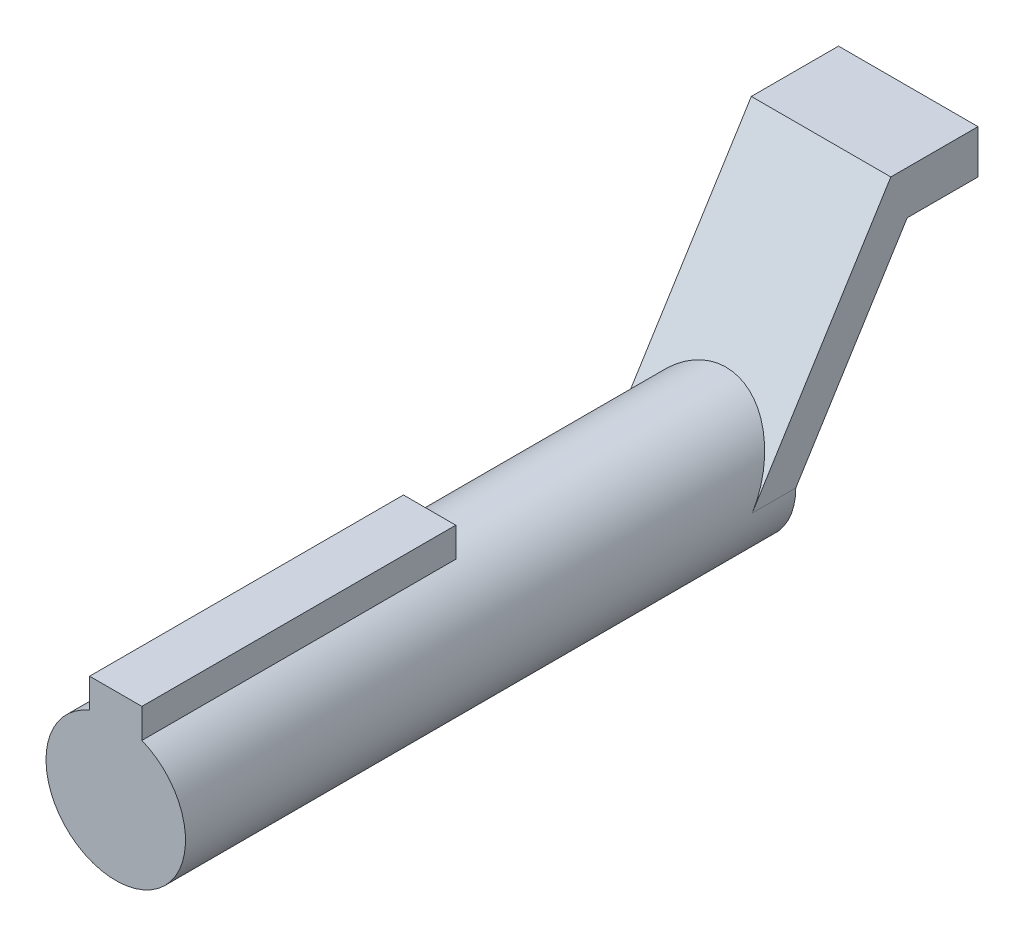
ISO-10303-21;
HEADER;
FILE_DESCRIPTION(('STEP AP214'),'2;1');
FILE_NAME('part.step','',(''),(''),'','','');
FILE_SCHEMA(('AUTOMOTIVE_DESIGN { 1 0 10303 214 1 1 1 1 }'));
ENDSEC;
DATA;
#1=APPLICATION_CONTEXT('core data for automotive mechanical design processes');
#2=APPLICATION_PROTOCOL_DEFINITION('international standard','automotive_design',2000,#1);
#3=PRODUCT_CONTEXT('',#1,'mechanical');
#4=PRODUCT('Part','Part','',(#3));
#5=PRODUCT_RELATED_PRODUCT_CATEGORY('part','',(#4));
#6=PRODUCT_DEFINITION_FORMATION('','',#4);
#7=PRODUCT_DEFINITION_CONTEXT('part definition',#1,'design');
#8=PRODUCT_DEFINITION('design','',#6,#7);
#9=PRODUCT_DEFINITION_SHAPE('','',#8);
#10=(LENGTH_UNIT() NAMED_UNIT(*) SI_UNIT(.MILLI.,.METRE.));
#11=(NAMED_UNIT(*) PLANE_ANGLE_UNIT() SI_UNIT($,.RADIAN.));
#12=(NAMED_UNIT(*) SI_UNIT($,.STERADIAN.) SOLID_ANGLE_UNIT());
#13=UNCERTAINTY_MEASURE_WITH_UNIT(LENGTH_MEASURE(1.E-05),#10,'distance_accuracy_value','');
#14=(GEOMETRIC_REPRESENTATION_CONTEXT(3) GLOBAL_UNCERTAINTY_ASSIGNED_CONTEXT((#13)) GLOBAL_UNIT_ASSIGNED_CONTEXT((#10,
#11,#12)) REPRESENTATION_CONTEXT('',''));
#15=CARTESIAN_POINT('',(0.,0.,0.));
#16=DIRECTION('',(0.,0.,1.));
#17=DIRECTION('',(1.,0.,0.));
#18=AXIS2_PLACEMENT_3D('',#15,#16,#17);
#19=CARTESIAN_POINT('',(0.,0.,35.));
#20=DIRECTION('',(0.,0.,-1.));
#21=DIRECTION('',(-1.,0.,0.));
#22=AXIS2_PLACEMENT_3D('',#19,#20,#21);
#23=CYLINDRICAL_SURFACE('',#22,4.);
#24=DIRECTION('',(0.,0.,-1.));
#25=VECTOR('',#24,1.);
#26=CARTESIAN_POINT('',(4.,0.,0.));
#27=LINE('',#26,#25);
#28=CARTESIAN_POINT('',(4.,0.,2.5));
#29=VERTEX_POINT('',#28);
#30=CARTESIAN_POINT('',(4.,0.,0.));
#31=VERTEX_POINT('',#30);
#32=EDGE_CURVE('E68',#29,#31,#27,.T.);
#33=ORIENTED_EDGE('',*,*,#32,.F.);
#34=CARTESIAN_POINT('',(0.,0.,2.5));
#35=DIRECTION('',(0.,0.52999894000318,0.847998304005088));
#36=DIRECTION('',(0.,0.847998304005088,-0.52999894000318));
#37=AXIS2_PLACEMENT_3D('',#34,#35,#36);
#38=ELLIPSE('',#37,4.7169905660283,4.);
#39=CARTESIAN_POINT('',(-4.,0.,2.5));
#40=VERTEX_POINT('',#39);
#41=EDGE_CURVE('E214',#29,#40,#38,.T.);
#42=ORIENTED_EDGE('',*,*,#41,.T.);
#43=DIRECTION('',(0.,0.,-1.));
#44=VECTOR('',#43,1.);
#45=CARTESIAN_POINT('',(-4.,0.,0.));
#46=LINE('',#45,#44);
#47=CARTESIAN_POINT('',(-4.,0.,0.));
#48=VERTEX_POINT('',#47);
#49=EDGE_CURVE('E173',#40,#48,#46,.T.);
#50=ORIENTED_EDGE('',*,*,#49,.T.);
#51=CARTESIAN_POINT('',(0.,0.,0.));
#52=DIRECTION('',(0.,0.,1.));
#53=DIRECTION('',(1.,0.,0.));
#54=AXIS2_PLACEMENT_3D('',#51,#52,#53);
#55=CIRCLE('',#54,4.);
#56=EDGE_CURVE('E229',#48,#31,#55,.T.);
#57=ORIENTED_EDGE('',*,*,#56,.T.);
#58=EDGE_LOOP('',(#33,#42,#50,#57));
#59=FACE_BOUND('',#58,.T.);
#60=DIRECTION('',(0.,0.,-1.));
#61=VECTOR('',#60,1.);
#62=CARTESIAN_POINT('',(-1.5,3.70809924354783,35.));
#63=LINE('',#62,#61);
#64=CARTESIAN_POINT('',(-1.5,3.70809924354783,17.));
#65=VERTEX_POINT('',#64);
#66=CARTESIAN_POINT('',(-1.5,3.70809924354783,35.));
#67=VERTEX_POINT('',#66);
#68=EDGE_CURVE('E159',#65,#67,#63,.F.);
#69=ORIENTED_EDGE('',*,*,#68,.F.);
#70=CARTESIAN_POINT('',(0.,0.,17.));
#71=DIRECTION('',(0.,0.,-1.));
#72=DIRECTION('',(-1.,0.,0.));
#73=AXIS2_PLACEMENT_3D('',#70,#71,#72);
#74=CIRCLE('',#73,4.);
#75=CARTESIAN_POINT('',(1.5,3.70809924354783,17.));
#76=VERTEX_POINT('',#75);
#77=EDGE_CURVE('E11',#65,#76,#74,.T.);
#78=ORIENTED_EDGE('',*,*,#77,.T.);
#79=DIRECTION('',(0.,0.,-1.));
#80=VECTOR('',#79,1.);
#81=CARTESIAN_POINT('',(1.5,3.70809924354783,35.));
#82=LINE('',#81,#80);
#83=CARTESIAN_POINT('',(1.5,3.70809924354783,35.));
#84=VERTEX_POINT('',#83);
#85=EDGE_CURVE('E154',#76,#84,#82,.F.);
#86=ORIENTED_EDGE('',*,*,#85,.T.);
#87=CARTESIAN_POINT('',(0.,0.,35.));
#88=DIRECTION('',(0.,0.,1.));
#89=DIRECTION('',(1.,0.,0.));
#90=AXIS2_PLACEMENT_3D('',#87,#88,#89);
#91=CIRCLE('',#90,4.);
#92=EDGE_CURVE('E53',#67,#84,#91,.T.);
#93=ORIENTED_EDGE('',*,*,#92,.F.);
#94=EDGE_LOOP('',(#69,#78,#86,#93));
#95=FACE_BOUND('',#94,.T.);
#96=ADVANCED_FACE('F45',(#59,#95),#23,.T.);
#97=CARTESIAN_POINT('',(0.,0.,0.));
#98=DIRECTION('',(0.,0.,1.));
#99=DIRECTION('',(1.,0.,0.));
#100=AXIS2_PLACEMENT_3D('',#97,#98,#99);
#101=PLANE('',#100);
#102=DIRECTION('',(-1.,0.,0.));
#103=VECTOR('',#102,1.);
#104=CARTESIAN_POINT('',(22.1521304810338,0.,0.));
#105=LINE('',#104,#103);
#106=EDGE_CURVE('E219',#31,#48,#105,.T.);
#107=ORIENTED_EDGE('',*,*,#106,.F.);
#108=ORIENTED_EDGE('',*,*,#56,.F.);
#109=EDGE_LOOP('',(#107,#108));
#110=FACE_BOUND('',#109,.T.);
#111=ADVANCED_FACE('F272',(#110),#101,.F.);
#112=CARTESIAN_POINT('',(0.,0.,35.));
#113=DIRECTION('',(0.,0.,1.));
#114=DIRECTION('',(1.,0.,0.));
#115=AXIS2_PLACEMENT_3D('',#112,#113,#114);
#116=PLANE('',#115);
#117=ORIENTED_EDGE('',*,*,#92,.T.);
#118=DIRECTION('',(0.,1.,0.));
#119=VECTOR('',#118,1.);
#120=CARTESIAN_POINT('',(1.5,0.,35.));
#121=LINE('',#120,#119);
#122=CARTESIAN_POINT('',(1.5,5.4,35.));
#123=VERTEX_POINT('',#122);
#124=EDGE_CURVE('E140',#84,#123,#121,.T.);
#125=ORIENTED_EDGE('',*,*,#124,.T.);
#126=DIRECTION('',(1.,0.,0.));
#127=VECTOR('',#126,1.);
#128=CARTESIAN_POINT('',(-1.5,5.4,35.));
#129=LINE('',#128,#127);
#130=CARTESIAN_POINT('',(-1.5,5.4,35.));
#131=VERTEX_POINT('',#130);
#132=EDGE_CURVE('E389',#131,#123,#129,.T.);
#133=ORIENTED_EDGE('',*,*,#132,.F.);
#134=DIRECTION('',(0.,1.,0.));
#135=VECTOR('',#134,1.);
#136=CARTESIAN_POINT('',(-1.5,0.,35.));
#137=LINE('',#136,#135);
#138=EDGE_CURVE('E60',#67,#131,#137,.T.);
#139=ORIENTED_EDGE('',*,*,#138,.F.);
#140=EDGE_LOOP('',(#117,#125,#133,#139));
#141=FACE_BOUND('',#140,.T.);
#142=ADVANCED_FACE('F268',(#141),#116,.T.);
#143=CARTESIAN_POINT('',(22.1521304810338,1.12359550561798,1.79775280898876));
#144=DIRECTION('',(0.,0.52999894000318,0.847998304005088));
#145=DIRECTION('',(0.,-0.847998304005088,0.52999894000318));
#146=AXIS2_PLACEMENT_3D('',#143,#144,#145);
#147=PLANE('',#146);
#148=ORIENTED_EDGE('',*,*,#41,.F.);
#149=DIRECTION('',(0.,0.847998304005088,-0.52999894000318));
#150=VECTOR('',#149,1.);
#151=CARTESIAN_POINT('',(4.,1.12359550561798,1.79775280898876));
#152=LINE('',#151,#150);
#153=CARTESIAN_POINT('',(4.,12.7199745600763,-5.4499841000477));
#154=VERTEX_POINT('',#153);
#155=EDGE_CURVE('E199',#29,#154,#152,.T.);
#156=ORIENTED_EDGE('',*,*,#155,.T.);
#157=DIRECTION('',(-1.,0.,0.));
#158=VECTOR('',#157,1.);
#159=CARTESIAN_POINT('',(22.1521304810338,12.7199745600763,-5.4499841000477));
#160=LINE('',#159,#158);
#161=CARTESIAN_POINT('',(-4.,12.7199745600763,-5.4499841000477));
#162=VERTEX_POINT('',#161);
#163=EDGE_CURVE('E202',#154,#162,#160,.T.);
#164=ORIENTED_EDGE('',*,*,#163,.T.);
#165=DIRECTION('',(0.,0.847998304005088,-0.52999894000318));
#166=VECTOR('',#165,1.);
#167=CARTESIAN_POINT('',(-4.,1.12359550561798,1.79775280898876));
#168=LINE('',#167,#166);
#169=EDGE_CURVE('E167',#40,#162,#168,.T.);
#170=ORIENTED_EDGE('',*,*,#169,.F.);
#171=EDGE_LOOP('',(#148,#156,#164,#170));
#172=FACE_BOUND('',#171,.T.);
#173=ADVANCED_FACE('F247',(#172),#147,.T.);
#174=CARTESIAN_POINT('',(22.1521304810338,0.,-10.4499841000477));
#175=DIRECTION('',(0.,0.,-1.));
#176=DIRECTION('',(-1.,0.,0.));
#177=AXIS2_PLACEMENT_3D('',#174,#175,#176);
#178=PLANE('',#177);
#179=DIRECTION('',(-1.,0.,0.));
#180=VECTOR('',#179,1.);
#181=CARTESIAN_POINT('',(22.1521304810338,12.7199745600763,-10.4499841000477));
#182=LINE('',#181,#180);
#183=CARTESIAN_POINT('',(4.,12.7199745600763,-10.4499841000477));
#184=VERTEX_POINT('',#183);
#185=CARTESIAN_POINT('',(-4.,12.7199745600763,-10.4499841000477));
#186=VERTEX_POINT('',#185);
#187=EDGE_CURVE('E203',#184,#186,#182,.T.);
#188=ORIENTED_EDGE('',*,*,#187,.F.);
#189=DIRECTION('',(0.,-1.,0.));
#190=VECTOR('',#189,1.);
#191=CARTESIAN_POINT('',(4.,0.,-10.4499841000477));
#192=LINE('',#191,#190);
#193=CARTESIAN_POINT('',(4.,10.2199745600763,-10.4499841000477));
#194=VERTEX_POINT('',#193);
#195=EDGE_CURVE('E171',#184,#194,#192,.T.);
#196=ORIENTED_EDGE('',*,*,#195,.T.);
#197=DIRECTION('',(-1.,0.,0.));
#198=VECTOR('',#197,1.);
#199=CARTESIAN_POINT('',(22.1521304810338,10.2199745600763,-10.4499841000477));
#200=LINE('',#199,#198);
#201=CARTESIAN_POINT('',(-4.,10.2199745600763,-10.4499841000477));
#202=VERTEX_POINT('',#201);
#203=EDGE_CURVE('E207',#194,#202,#200,.T.);
#204=ORIENTED_EDGE('',*,*,#203,.T.);
#205=DIRECTION('',(0.,-1.,0.));
#206=VECTOR('',#205,1.);
#207=CARTESIAN_POINT('',(-4.,0.,-10.4499841000477));
#208=LINE('',#207,#206);
#209=EDGE_CURVE('E172',#186,#202,#208,.T.);
#210=ORIENTED_EDGE('',*,*,#209,.F.);
#211=EDGE_LOOP('',(#188,#196,#204,#210));
#212=FACE_BOUND('',#211,.T.);
#213=ADVANCED_FACE('F260',(#212),#178,.T.);
#214=CARTESIAN_POINT('',(22.1521304810338,12.7199745600763,0.));
#215=DIRECTION('',(0.,1.,0.));
#216=DIRECTION('',(0.,0.,1.));
#217=AXIS2_PLACEMENT_3D('',#214,#215,#216);
#218=PLANE('',#217);
#219=ORIENTED_EDGE('',*,*,#163,.F.);
#220=DIRECTION('',(0.,0.,-1.));
#221=VECTOR('',#220,1.);
#222=CARTESIAN_POINT('',(4.,12.7199745600763,0.));
#223=LINE('',#222,#221);
#224=EDGE_CURVE('E204',#154,#184,#223,.T.);
#225=ORIENTED_EDGE('',*,*,#224,.T.);
#226=ORIENTED_EDGE('',*,*,#187,.T.);
#227=DIRECTION('',(0.,0.,-1.));
#228=VECTOR('',#227,1.);
#229=CARTESIAN_POINT('',(-4.,12.7199745600763,0.));
#230=LINE('',#229,#228);
#231=EDGE_CURVE('E177',#162,#186,#230,.T.);
#232=ORIENTED_EDGE('',*,*,#231,.F.);
#233=EDGE_LOOP('',(#219,#225,#226,#232));
#234=FACE_BOUND('',#233,.T.);
#235=ADVANCED_FACE('F251',(#234),#218,.T.);
#236=CARTESIAN_POINT('',(22.1521304810338,0.,0.));
#237=DIRECTION('',(0.,0.52999894000318,0.847998304005088));
#238=DIRECTION('',(0.,-0.847998304005088,0.52999894000318));
#239=AXIS2_PLACEMENT_3D('',#236,#237,#238);
#240=PLANE('',#239);
#241=DIRECTION('',(0.,0.847998304005088,-0.52999894000318));
#242=VECTOR('',#241,1.);
#243=CARTESIAN_POINT('',(4.,0.,0.));
#244=LINE('',#243,#242);
#245=CARTESIAN_POINT('',(4.,10.2199745600763,-6.3874841000477));
#246=VERTEX_POINT('',#245);
#247=EDGE_CURVE('E191',#31,#246,#244,.T.);
#248=ORIENTED_EDGE('',*,*,#247,.F.);
#249=ORIENTED_EDGE('',*,*,#106,.T.);
#250=DIRECTION('',(0.,0.847998304005088,-0.52999894000318));
#251=VECTOR('',#250,1.);
#252=CARTESIAN_POINT('',(-4.,0.,0.));
#253=LINE('',#252,#251);
#254=CARTESIAN_POINT('',(-4.,10.2199745600763,-6.3874841000477));
#255=VERTEX_POINT('',#254);
#256=EDGE_CURVE('E178',#48,#255,#253,.T.);
#257=ORIENTED_EDGE('',*,*,#256,.T.);
#258=DIRECTION('',(-1.,0.,0.));
#259=VECTOR('',#258,1.);
#260=CARTESIAN_POINT('',(22.1521304810338,10.2199745600763,-6.3874841000477));
#261=LINE('',#260,#259);
#262=EDGE_CURVE('E198',#246,#255,#261,.T.);
#263=ORIENTED_EDGE('',*,*,#262,.F.);
#264=EDGE_LOOP('',(#248,#249,#257,#263));
#265=FACE_BOUND('',#264,.T.);
#266=ADVANCED_FACE('F237',(#265),#240,.F.);
#267=CARTESIAN_POINT('',(22.1521304810338,10.2199745600763,0.));
#268=DIRECTION('',(0.,1.,0.));
#269=DIRECTION('',(0.,0.,1.));
#270=AXIS2_PLACEMENT_3D('',#267,#268,#269);
#271=PLANE('',#270);
#272=DIRECTION('',(0.,0.,-1.));
#273=VECTOR('',#272,1.);
#274=CARTESIAN_POINT('',(4.,10.2199745600763,0.));
#275=LINE('',#274,#273);
#276=EDGE_CURVE('E195',#246,#194,#275,.T.);
#277=ORIENTED_EDGE('',*,*,#276,.F.);
#278=ORIENTED_EDGE('',*,*,#262,.T.);
#279=DIRECTION('',(0.,0.,-1.));
#280=VECTOR('',#279,1.);
#281=CARTESIAN_POINT('',(-4.,10.2199745600763,0.));
#282=LINE('',#281,#280);
#283=EDGE_CURVE('E166',#255,#202,#282,.T.);
#284=ORIENTED_EDGE('',*,*,#283,.T.);
#285=ORIENTED_EDGE('',*,*,#203,.F.);
#286=EDGE_LOOP('',(#277,#278,#284,#285));
#287=FACE_BOUND('',#286,.T.);
#288=ADVANCED_FACE('F258',(#287),#271,.F.);
#289=CARTESIAN_POINT('',(4.,0.,0.));
#290=DIRECTION('',(1.,0.,0.));
#291=DIRECTION('',(0.,0.,-1.));
#292=AXIS2_PLACEMENT_3D('',#289,#290,#291);
#293=PLANE('',#292);
#294=ORIENTED_EDGE('',*,*,#195,.F.);
#295=ORIENTED_EDGE('',*,*,#224,.F.);
#296=ORIENTED_EDGE('',*,*,#155,.F.);
#297=ORIENTED_EDGE('',*,*,#32,.T.);
#298=ORIENTED_EDGE('',*,*,#247,.T.);
#299=ORIENTED_EDGE('',*,*,#276,.T.);
#300=EDGE_LOOP('',(#294,#295,#296,#297,#298,#299));
#301=FACE_BOUND('',#300,.T.);
#302=ADVANCED_FACE('F243',(#301),#293,.T.);
#303=CARTESIAN_POINT('',(-4.,0.,0.));
#304=DIRECTION('',(-1.,0.,0.));
#305=DIRECTION('',(0.,0.,1.));
#306=AXIS2_PLACEMENT_3D('',#303,#304,#305);
#307=PLANE('',#306);
#308=ORIENTED_EDGE('',*,*,#231,.T.);
#309=ORIENTED_EDGE('',*,*,#209,.T.);
#310=ORIENTED_EDGE('',*,*,#283,.F.);
#311=ORIENTED_EDGE('',*,*,#256,.F.);
#312=ORIENTED_EDGE('',*,*,#49,.F.);
#313=ORIENTED_EDGE('',*,*,#169,.T.);
#314=EDGE_LOOP('',(#308,#309,#310,#311,#312,#313));
#315=FACE_BOUND('',#314,.T.);
#316=ADVANCED_FACE('F255',(#315),#307,.T.);
#317=CARTESIAN_POINT('',(-1.5,0.,17.));
#318=DIRECTION('',(1.,0.,0.));
#319=DIRECTION('',(0.,0.,-1.));
#320=AXIS2_PLACEMENT_3D('',#317,#318,#319);
#321=PLANE('',#320);
#322=DIRECTION('',(0.,1.,0.));
#323=VECTOR('',#322,1.);
#324=CARTESIAN_POINT('',(-1.5,0.,17.));
#325=LINE('',#324,#323);
#326=CARTESIAN_POINT('',(-1.5,5.4,17.));
#327=VERTEX_POINT('',#326);
#328=EDGE_CURVE('E130',#65,#327,#325,.T.);
#329=ORIENTED_EDGE('',*,*,#328,.F.);
#330=ORIENTED_EDGE('',*,*,#68,.T.);
#331=ORIENTED_EDGE('',*,*,#138,.T.);
#332=DIRECTION('',(0.,0.,1.));
#333=VECTOR('',#332,1.);
#334=CARTESIAN_POINT('',(-1.5,5.4,17.));
#335=LINE('',#334,#333);
#336=EDGE_CURVE('E146',#327,#131,#335,.T.);
#337=ORIENTED_EDGE('',*,*,#336,.F.);
#338=EDGE_LOOP('',(#329,#330,#331,#337));
#339=FACE_BOUND('',#338,.T.);
#340=ADVANCED_FACE('F152',(#339),#321,.F.);
#341=CARTESIAN_POINT('',(1.5,0.,17.));
#342=DIRECTION('',(1.,0.,0.));
#343=DIRECTION('',(0.,1.,0.));
#344=AXIS2_PLACEMENT_3D('',#341,#342,#343);
#345=PLANE('',#344);
#346=ORIENTED_EDGE('',*,*,#85,.F.);
#347=DIRECTION('',(0.,1.,0.));
#348=VECTOR('',#347,1.);
#349=CARTESIAN_POINT('',(1.5,0.,17.));
#350=LINE('',#349,#348);
#351=CARTESIAN_POINT('',(1.5,5.4,17.));
#352=VERTEX_POINT('',#351);
#353=EDGE_CURVE('E150',#76,#352,#350,.T.);
#354=ORIENTED_EDGE('',*,*,#353,.T.);
#355=DIRECTION('',(0.,0.,1.));
#356=VECTOR('',#355,1.);
#357=CARTESIAN_POINT('',(1.5,5.4,17.));
#358=LINE('',#357,#356);
#359=EDGE_CURVE('E148',#352,#123,#358,.T.);
#360=ORIENTED_EDGE('',*,*,#359,.T.);
#361=ORIENTED_EDGE('',*,*,#124,.F.);
#362=EDGE_LOOP('',(#346,#354,#360,#361));
#363=FACE_BOUND('',#362,.T.);
#364=ADVANCED_FACE('F294',(#363),#345,.T.);
#365=CARTESIAN_POINT('',(-1.5,5.4,17.));
#366=DIRECTION('',(0.,-1.,0.));
#367=DIRECTION('',(0.,0.,-1.));
#368=AXIS2_PLACEMENT_3D('',#365,#366,#367);
#369=PLANE('',#368);
#370=ORIENTED_EDGE('',*,*,#132,.T.);
#371=ORIENTED_EDGE('',*,*,#359,.F.);
#372=DIRECTION('',(1.,0.,0.));
#373=VECTOR('',#372,1.);
#374=CARTESIAN_POINT('',(-1.5,5.4,17.));
#375=LINE('',#374,#373);
#376=EDGE_CURVE('E134',#327,#352,#375,.T.);
#377=ORIENTED_EDGE('',*,*,#376,.F.);
#378=ORIENTED_EDGE('',*,*,#336,.T.);
#379=EDGE_LOOP('',(#370,#371,#377,#378));
#380=FACE_BOUND('',#379,.T.);
#381=ADVANCED_FACE('F145',(#380),#369,.F.);
#382=CARTESIAN_POINT('',(0.,0.,17.));
#383=DIRECTION('',(0.,0.,-1.));
#384=DIRECTION('',(-1.,0.,0.));
#385=AXIS2_PLACEMENT_3D('',#382,#383,#384);
#386=PLANE('',#385);
#387=ORIENTED_EDGE('',*,*,#77,.F.);
#388=ORIENTED_EDGE('',*,*,#328,.T.);
#389=ORIENTED_EDGE('',*,*,#376,.T.);
#390=ORIENTED_EDGE('',*,*,#353,.F.);
#391=EDGE_LOOP('',(#387,#388,#389,#390));
#392=FACE_BOUND('',#391,.T.);
#393=ADVANCED_FACE('F132',(#392),#386,.T.);
#394=CLOSED_SHELL('',(#96,#111,#142,#173,#213,#235,#266,#288,#302,#316,#340,#364,#381,#393));
#395=MANIFOLD_SOLID_BREP('B2',#394);
#396=ADVANCED_BREP_SHAPE_REPRESENTATION('',(#18,#395),#14);
#397=SHAPE_DEFINITION_REPRESENTATION(#9,#396);
ENDSEC;
END-ISO-10303-21;
